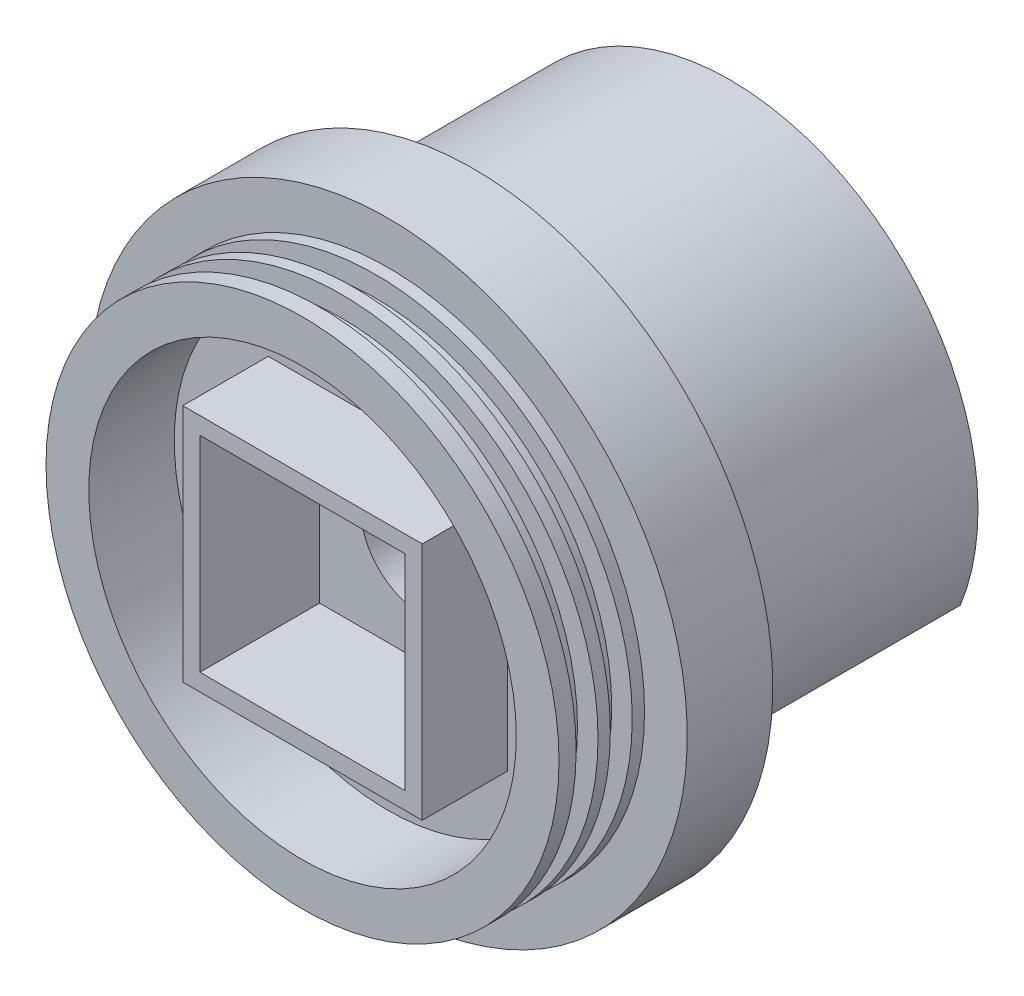
ISO-10303-21;
HEADER;
FILE_DESCRIPTION(('STEP AP214'),'2;1');
FILE_NAME('part.step','',(''),(''),'','','');
FILE_SCHEMA(('AUTOMOTIVE_DESIGN { 1 0 10303 214 1 1 1 1 }'));
ENDSEC;
DATA;
#1=APPLICATION_CONTEXT('core data for automotive mechanical design processes');
#2=APPLICATION_PROTOCOL_DEFINITION('international standard','automotive_design',2000,#1);
#3=PRODUCT_CONTEXT('',#1,'mechanical');
#4=PRODUCT('Part','Part','',(#3));
#5=PRODUCT_RELATED_PRODUCT_CATEGORY('part','',(#4));
#6=PRODUCT_DEFINITION_FORMATION('','',#4);
#7=PRODUCT_DEFINITION_CONTEXT('part definition',#1,'design');
#8=PRODUCT_DEFINITION('design','',#6,#7);
#9=PRODUCT_DEFINITION_SHAPE('','',#8);
#10=(LENGTH_UNIT() NAMED_UNIT(*) SI_UNIT(.MILLI.,.METRE.));
#11=(NAMED_UNIT(*) PLANE_ANGLE_UNIT() SI_UNIT($,.RADIAN.));
#12=(NAMED_UNIT(*) SI_UNIT($,.STERADIAN.) SOLID_ANGLE_UNIT());
#13=UNCERTAINTY_MEASURE_WITH_UNIT(LENGTH_MEASURE(1.E-05),#10,'distance_accuracy_value','');
#14=(GEOMETRIC_REPRESENTATION_CONTEXT(3) GLOBAL_UNCERTAINTY_ASSIGNED_CONTEXT((#13)) GLOBAL_UNIT_ASSIGNED_CONTEXT((#10,
#11,#12)) REPRESENTATION_CONTEXT('',''));
#15=CARTESIAN_POINT('',(0.,0.,0.));
#16=DIRECTION('',(0.,0.,1.));
#17=DIRECTION('',(1.,0.,0.));
#18=AXIS2_PLACEMENT_3D('',#15,#16,#17);
#19=CARTESIAN_POINT('',(0.,0.,0.));
#20=DIRECTION('',(0.,0.,1.));
#21=DIRECTION('',(1.,0.,0.));
#22=AXIS2_PLACEMENT_3D('',#19,#20,#21);
#23=PLANE('',#22);
#24=CARTESIAN_POINT('',(0.,0.,0.));
#25=DIRECTION('',(0.,0.,1.));
#26=DIRECTION('',(1.,0.,0.));
#27=AXIS2_PLACEMENT_3D('',#24,#25,#26);
#28=CIRCLE('',#27,31.75);
#29=CARTESIAN_POINT('',(31.75,0.,0.));
#30=VERTEX_POINT('',#29);
#31=EDGE_CURVE('E246',#30,#30,#28,.T.);
#32=ORIENTED_EDGE('',*,*,#31,.T.);
#33=EDGE_LOOP('',(#32));
#34=FACE_BOUND('',#33,.T.);
#35=DIRECTION('',(-1.,0.,0.));
#36=VECTOR('',#35,1.);
#37=CARTESIAN_POINT('',(-17.78,17.78,0.));
#38=LINE('',#37,#36);
#39=CARTESIAN_POINT('',(17.78,17.78,0.));
#40=VERTEX_POINT('',#39);
#41=CARTESIAN_POINT('',(-17.78,17.78,0.));
#42=VERTEX_POINT('',#41);
#43=EDGE_CURVE('E188',#40,#42,#38,.T.);
#44=ORIENTED_EDGE('',*,*,#43,.F.);
#45=DIRECTION('',(0.,1.,0.));
#46=VECTOR('',#45,1.);
#47=CARTESIAN_POINT('',(17.78,17.78,0.));
#48=LINE('',#47,#46);
#49=CARTESIAN_POINT('',(17.78,-17.78,0.));
#50=VERTEX_POINT('',#49);
#51=EDGE_CURVE('E174',#50,#40,#48,.T.);
#52=ORIENTED_EDGE('',*,*,#51,.F.);
#53=DIRECTION('',(1.,0.,0.));
#54=VECTOR('',#53,1.);
#55=CARTESIAN_POINT('',(17.78,-17.78,0.));
#56=LINE('',#55,#54);
#57=CARTESIAN_POINT('',(-17.78,-17.78,0.));
#58=VERTEX_POINT('',#57);
#59=EDGE_CURVE('E179',#58,#50,#56,.T.);
#60=ORIENTED_EDGE('',*,*,#59,.F.);
#61=DIRECTION('',(0.,-1.,0.));
#62=VECTOR('',#61,1.);
#63=CARTESIAN_POINT('',(-17.78,-17.78,0.));
#64=LINE('',#63,#62);
#65=EDGE_CURVE('E190',#42,#58,#64,.T.);
#66=ORIENTED_EDGE('',*,*,#65,.F.);
#67=EDGE_LOOP('',(#44,#52,#60,#66));
#68=FACE_BOUND('',#67,.T.);
#69=ADVANCED_FACE('F35',(#34,#68),#23,.T.);
#70=CARTESIAN_POINT('',(0.,0.,12.7));
#71=DIRECTION('',(0.,0.,-1.));
#72=DIRECTION('',(-1.,0.,0.));
#73=AXIS2_PLACEMENT_3D('',#70,#71,#72);
#74=CYLINDRICAL_SURFACE('',#73,38.1);
#75=CARTESIAN_POINT('',(0.,0.,0.));
#76=DIRECTION('',(0.,0.,1.));
#77=DIRECTION('',(1.,0.,0.));
#78=AXIS2_PLACEMENT_3D('',#75,#76,#77);
#79=CIRCLE('',#78,38.1);
#80=CARTESIAN_POINT('',(38.1,0.,0.));
#81=VERTEX_POINT('',#80);
#82=EDGE_CURVE('E271',#81,#81,#79,.T.);
#83=ORIENTED_EDGE('',*,*,#82,.T.);
#84=EDGE_LOOP('',(#83));
#85=FACE_BOUND('',#84,.T.);
#86=CARTESIAN_POINT('',(0.,0.,1.8288));
#87=DIRECTION('',(0.,0.,1.));
#88=DIRECTION('',(1.,0.,0.));
#89=AXIS2_PLACEMENT_3D('',#86,#87,#88);
#90=CIRCLE('',#89,38.1);
#91=CARTESIAN_POINT('',(38.1,0.,1.8288));
#92=VERTEX_POINT('',#91);
#93=EDGE_CURVE('E209',#92,#92,#90,.T.);
#94=ORIENTED_EDGE('',*,*,#93,.F.);
#95=EDGE_LOOP('',(#94));
#96=FACE_BOUND('',#95,.T.);
#97=ADVANCED_FACE('F330',(#85,#96),#74,.T.);
#98=CARTESIAN_POINT('',(0.,0.,5.08));
#99=DIRECTION('',(0.,0.,1.));
#100=DIRECTION('',(1.,0.,0.));
#101=AXIS2_PLACEMENT_3D('',#98,#99,#100);
#102=CIRCLE('',#101,38.1);
#103=CARTESIAN_POINT('',(38.1,0.,5.08));
#104=VERTEX_POINT('',#103);
#105=EDGE_CURVE('E205',#104,#104,#102,.T.);
#106=ORIENTED_EDGE('',*,*,#105,.T.);
#107=EDGE_LOOP('',(#106));
#108=FACE_BOUND('',#107,.T.);
#109=CARTESIAN_POINT('',(0.,0.,6.9088));
#110=DIRECTION('',(0.,0.,1.));
#111=DIRECTION('',(1.,0.,0.));
#112=AXIS2_PLACEMENT_3D('',#109,#110,#111);
#113=CIRCLE('',#112,38.1);
#114=CARTESIAN_POINT('',(38.1,0.,6.9088));
#115=VERTEX_POINT('',#114);
#116=EDGE_CURVE('E221',#115,#115,#113,.T.);
#117=ORIENTED_EDGE('',*,*,#116,.F.);
#118=EDGE_LOOP('',(#117));
#119=FACE_BOUND('',#118,.T.);
#120=ADVANCED_FACE('F338',(#108,#119),#74,.T.);
#121=CARTESIAN_POINT('',(0.,0.,-12.7));
#122=DIRECTION('',(0.,0.,-1.));
#123=DIRECTION('',(-1.,0.,0.));
#124=AXIS2_PLACEMENT_3D('',#121,#122,#123);
#125=PLANE('',#124);
#126=DIRECTION('',(-1.,0.,0.));
#127=VECTOR('',#126,1.);
#128=CARTESIAN_POINT('',(0.,-16.1793756215138,-12.7));
#129=LINE('',#128,#127);
#130=CARTESIAN_POINT('',(-35.8918473263493,-16.1793756215137,-12.7));
#131=VERTEX_POINT('',#130);
#132=CARTESIAN_POINT('',(-27.3183144519929,-16.1793756215138,-12.7));
#133=VERTEX_POINT('',#132);
#134=EDGE_CURVE('E288',#131,#133,#129,.F.);
#135=ORIENTED_EDGE('',*,*,#134,.T.);
#136=CARTESIAN_POINT('',(0.,0.,-12.7));
#137=DIRECTION('',(0.,0.,-1.));
#138=DIRECTION('',(-1.,0.,0.));
#139=AXIS2_PLACEMENT_3D('',#136,#137,#138);
#140=CIRCLE('',#139,31.75);
#141=CARTESIAN_POINT('',(27.3183144519929,-16.1793756215138,-12.7));
#142=VERTEX_POINT('',#141);
#143=EDGE_CURVE('E290',#133,#142,#140,.T.);
#144=ORIENTED_EDGE('',*,*,#143,.T.);
#145=DIRECTION('',(-1.,0.,0.));
#146=VECTOR('',#145,1.);
#147=CARTESIAN_POINT('',(0.,-16.1793756215138,-12.7));
#148=LINE('',#147,#146);
#149=CARTESIAN_POINT('',(35.8918473263493,-16.1793756215137,-12.7));
#150=VERTEX_POINT('',#149);
#151=EDGE_CURVE('E286',#142,#150,#148,.F.);
#152=ORIENTED_EDGE('',*,*,#151,.T.);
#153=CARTESIAN_POINT('',(0.,0.,-12.7));
#154=DIRECTION('',(0.,0.,-1.));
#155=DIRECTION('',(-1.,0.,0.));
#156=AXIS2_PLACEMENT_3D('',#153,#154,#155);
#157=CIRCLE('',#156,39.37);
#158=EDGE_CURVE('E284',#150,#131,#157,.F.);
#159=ORIENTED_EDGE('',*,*,#158,.T.);
#160=EDGE_LOOP('',(#135,#144,#152,#159));
#161=FACE_BOUND('',#160,.T.);
#162=CARTESIAN_POINT('',(0.,0.,-12.7));
#163=DIRECTION('',(0.,0.,-1.));
#164=DIRECTION('',(-1.,0.,0.));
#165=AXIS2_PLACEMENT_3D('',#162,#163,#164);
#166=CIRCLE('',#165,9.144);
#167=CARTESIAN_POINT('',(-9.144,0.,-12.7));
#168=VERTEX_POINT('',#167);
#169=EDGE_CURVE('E264',#168,#168,#166,.T.);
#170=ORIENTED_EDGE('',*,*,#169,.F.);
#171=EDGE_LOOP('',(#170));
#172=FACE_BOUND('',#171,.T.);
#173=CARTESIAN_POINT('',(0.,0.,-12.7));
#174=DIRECTION('',(0.,0.,-1.));
#175=DIRECTION('',(-1.,0.,0.));
#176=AXIS2_PLACEMENT_3D('',#173,#174,#175);
#177=CIRCLE('',#176,44.45);
#178=CARTESIAN_POINT('',(-44.45,0.,-12.7));
#179=VERTEX_POINT('',#178);
#180=EDGE_CURVE('E268',#179,#179,#177,.T.);
#181=ORIENTED_EDGE('',*,*,#180,.T.);
#182=EDGE_LOOP('',(#181));
#183=FACE_BOUND('',#182,.T.);
#184=ADVANCED_FACE('F368',(#161,#172,#183),#125,.T.);
#185=CARTESIAN_POINT('',(15.24,15.24,-5.08));
#186=DIRECTION('',(1.,0.,0.));
#187=DIRECTION('',(0.,1.,0.));
#188=AXIS2_PLACEMENT_3D('',#185,#186,#187);
#189=PLANE('',#188);
#190=DIRECTION('',(0.,0.,1.));
#191=VECTOR('',#190,1.);
#192=CARTESIAN_POINT('',(15.24,-15.24,-5.08));
#193=LINE('',#192,#191);
#194=CARTESIAN_POINT('',(15.24,-15.24,-5.08));
#195=VERTEX_POINT('',#194);
#196=CARTESIAN_POINT('',(15.24,-15.24,12.7));
#197=VERTEX_POINT('',#196);
#198=EDGE_CURVE('E161',#195,#197,#193,.T.);
#199=ORIENTED_EDGE('',*,*,#198,.T.);
#200=DIRECTION('',(0.,1.,0.));
#201=VECTOR('',#200,1.);
#202=CARTESIAN_POINT('',(15.24,15.24,12.7));
#203=LINE('',#202,#201);
#204=CARTESIAN_POINT('',(15.24,15.24,12.7));
#205=VERTEX_POINT('',#204);
#206=EDGE_CURVE('E159',#197,#205,#203,.T.);
#207=ORIENTED_EDGE('',*,*,#206,.T.);
#208=DIRECTION('',(0.,0.,1.));
#209=VECTOR('',#208,1.);
#210=CARTESIAN_POINT('',(15.24,15.24,-5.08));
#211=LINE('',#210,#209);
#212=CARTESIAN_POINT('',(15.24,15.24,-5.08));
#213=VERTEX_POINT('',#212);
#214=EDGE_CURVE('E144',#213,#205,#211,.T.);
#215=ORIENTED_EDGE('',*,*,#214,.F.);
#216=DIRECTION('',(0.,1.,0.));
#217=VECTOR('',#216,1.);
#218=CARTESIAN_POINT('',(15.24,15.24,-5.08));
#219=LINE('',#218,#217);
#220=EDGE_CURVE('E249',#195,#213,#219,.T.);
#221=ORIENTED_EDGE('',*,*,#220,.F.);
#222=EDGE_LOOP('',(#199,#207,#215,#221));
#223=FACE_BOUND('',#222,.T.);
#224=ADVANCED_FACE('F160',(#223),#189,.F.);
#225=CARTESIAN_POINT('',(-15.24,-15.24,-5.08));
#226=DIRECTION('',(0.,-1.,0.));
#227=DIRECTION('',(0.,0.,-1.));
#228=AXIS2_PLACEMENT_3D('',#225,#226,#227);
#229=PLANE('',#228);
#230=DIRECTION('',(0.,0.,1.));
#231=VECTOR('',#230,1.);
#232=CARTESIAN_POINT('',(-15.24,-15.24,-5.08));
#233=LINE('',#232,#231);
#234=CARTESIAN_POINT('',(-15.24,-15.24,-5.08));
#235=VERTEX_POINT('',#234);
#236=CARTESIAN_POINT('',(-15.24,-15.24,12.7));
#237=VERTEX_POINT('',#236);
#238=EDGE_CURVE('E261',#235,#237,#233,.T.);
#239=ORIENTED_EDGE('',*,*,#238,.T.);
#240=DIRECTION('',(1.,0.,0.));
#241=VECTOR('',#240,1.);
#242=CARTESIAN_POINT('',(15.24,-15.24,12.7));
#243=LINE('',#242,#241);
#244=EDGE_CURVE('E170',#237,#197,#243,.T.);
#245=ORIENTED_EDGE('',*,*,#244,.T.);
#246=ORIENTED_EDGE('',*,*,#198,.F.);
#247=DIRECTION('',(1.,0.,0.));
#248=VECTOR('',#247,1.);
#249=CARTESIAN_POINT('',(-15.24,-15.24,-5.08));
#250=LINE('',#249,#248);
#251=EDGE_CURVE('E156',#235,#195,#250,.T.);
#252=ORIENTED_EDGE('',*,*,#251,.F.);
#253=EDGE_LOOP('',(#239,#245,#246,#252));
#254=FACE_BOUND('',#253,.T.);
#255=ADVANCED_FACE('F355',(#254),#229,.F.);
#256=CARTESIAN_POINT('',(-15.24,15.24,-5.08));
#257=DIRECTION('',(-1.,0.,0.));
#258=DIRECTION('',(0.,-1.,0.));
#259=AXIS2_PLACEMENT_3D('',#256,#257,#258);
#260=PLANE('',#259);
#261=DIRECTION('',(0.,0.,1.));
#262=VECTOR('',#261,1.);
#263=CARTESIAN_POINT('',(-15.24,15.24,-5.08));
#264=LINE('',#263,#262);
#265=CARTESIAN_POINT('',(-15.24,15.24,-5.08));
#266=VERTEX_POINT('',#265);
#267=CARTESIAN_POINT('',(-15.24,15.24,12.7));
#268=VERTEX_POINT('',#267);
#269=EDGE_CURVE('E155',#266,#268,#264,.T.);
#270=ORIENTED_EDGE('',*,*,#269,.T.);
#271=DIRECTION('',(0.,-1.,0.));
#272=VECTOR('',#271,1.);
#273=CARTESIAN_POINT('',(-15.24,-15.24,12.7));
#274=LINE('',#273,#272);
#275=EDGE_CURVE('E168',#268,#237,#274,.T.);
#276=ORIENTED_EDGE('',*,*,#275,.T.);
#277=ORIENTED_EDGE('',*,*,#238,.F.);
#278=DIRECTION('',(0.,-1.,0.));
#279=VECTOR('',#278,1.);
#280=CARTESIAN_POINT('',(-15.24,15.24,-5.08));
#281=LINE('',#280,#279);
#282=EDGE_CURVE('E254',#266,#235,#281,.T.);
#283=ORIENTED_EDGE('',*,*,#282,.F.);
#284=EDGE_LOOP('',(#270,#276,#277,#283));
#285=FACE_BOUND('',#284,.T.);
#286=ADVANCED_FACE('F358',(#285),#260,.F.);
#287=CARTESIAN_POINT('',(-15.24,15.24,-5.08));
#288=DIRECTION('',(0.,1.,0.));
#289=DIRECTION('',(0.,0.,1.));
#290=AXIS2_PLACEMENT_3D('',#287,#288,#289);
#291=PLANE('',#290);
#292=ORIENTED_EDGE('',*,*,#214,.T.);
#293=DIRECTION('',(-1.,0.,0.));
#294=VECTOR('',#293,1.);
#295=CARTESIAN_POINT('',(-15.24,15.24,12.7));
#296=LINE('',#295,#294);
#297=EDGE_CURVE('E148',#205,#268,#296,.T.);
#298=ORIENTED_EDGE('',*,*,#297,.T.);
#299=ORIENTED_EDGE('',*,*,#269,.F.);
#300=DIRECTION('',(-1.,0.,0.));
#301=VECTOR('',#300,1.);
#302=CARTESIAN_POINT('',(-15.24,15.24,-5.08));
#303=LINE('',#302,#301);
#304=EDGE_CURVE('E151',#213,#266,#303,.T.);
#305=ORIENTED_EDGE('',*,*,#304,.F.);
#306=EDGE_LOOP('',(#292,#298,#299,#305));
#307=FACE_BOUND('',#306,.T.);
#308=ADVANCED_FACE('F146',(#307),#291,.F.);
#309=CARTESIAN_POINT('',(0.,0.,12.7));
#310=DIRECTION('',(0.,0.,-1.));
#311=DIRECTION('',(-1.,0.,0.));
#312=AXIS2_PLACEMENT_3D('',#309,#310,#311);
#313=CYLINDRICAL_SURFACE('',#312,9.144);
#314=ORIENTED_EDGE('',*,*,#169,.T.);
#315=EDGE_LOOP('',(#314));
#316=FACE_BOUND('',#315,.T.);
#317=CARTESIAN_POINT('',(0.,0.,-5.08));
#318=DIRECTION('',(0.,0.,1.));
#319=DIRECTION('',(1.,0.,0.));
#320=AXIS2_PLACEMENT_3D('',#317,#318,#319);
#321=CIRCLE('',#320,9.144);
#322=CARTESIAN_POINT('',(9.144,0.,-5.08));
#323=VERTEX_POINT('',#322);
#324=EDGE_CURVE('E260',#323,#323,#321,.F.);
#325=ORIENTED_EDGE('',*,*,#324,.F.);
#326=EDGE_LOOP('',(#325));
#327=FACE_BOUND('',#326,.T.);
#328=ADVANCED_FACE('F365',(#316,#327),#313,.F.);
#329=CARTESIAN_POINT('',(0.,0.,10.16));
#330=DIRECTION('',(0.,0.,1.));
#331=DIRECTION('',(1.,0.,0.));
#332=AXIS2_PLACEMENT_3D('',#329,#330,#331);
#333=CIRCLE('',#332,38.1);
#334=CARTESIAN_POINT('',(38.1,0.,10.16));
#335=VERTEX_POINT('',#334);
#336=EDGE_CURVE('E218',#335,#335,#333,.T.);
#337=ORIENTED_EDGE('',*,*,#336,.T.);
#338=EDGE_LOOP('',(#337));
#339=FACE_BOUND('',#338,.T.);
#340=CARTESIAN_POINT('',(0.,0.,12.7));
#341=DIRECTION('',(0.,0.,1.));
#342=DIRECTION('',(1.,0.,0.));
#343=AXIS2_PLACEMENT_3D('',#340,#341,#342);
#344=CIRCLE('',#343,38.1);
#345=CARTESIAN_POINT('',(38.1,0.,12.7));
#346=VERTEX_POINT('',#345);
#347=EDGE_CURVE('E274',#346,#346,#344,.T.);
#348=ORIENTED_EDGE('',*,*,#347,.F.);
#349=EDGE_LOOP('',(#348));
#350=FACE_BOUND('',#349,.T.);
#351=ADVANCED_FACE('F340',(#339,#350),#74,.T.);
#352=CARTESIAN_POINT('',(0.,0.,12.7));
#353=DIRECTION('',(0.,0.,1.));
#354=DIRECTION('',(1.,0.,0.));
#355=AXIS2_PLACEMENT_3D('',#352,#353,#354);
#356=PLANE('',#355);
#357=CARTESIAN_POINT('',(0.,0.,12.7));
#358=DIRECTION('',(0.,0.,1.));
#359=DIRECTION('',(1.,0.,0.));
#360=AXIS2_PLACEMENT_3D('',#357,#358,#359);
#361=CIRCLE('',#360,31.75);
#362=CARTESIAN_POINT('',(31.75,0.,12.7));
#363=VERTEX_POINT('',#362);
#364=EDGE_CURVE('E245',#363,#363,#361,.T.);
#365=ORIENTED_EDGE('',*,*,#364,.F.);
#366=EDGE_LOOP('',(#365));
#367=FACE_BOUND('',#366,.T.);
#368=ORIENTED_EDGE('',*,*,#347,.T.);
#369=EDGE_LOOP('',(#368));
#370=FACE_BOUND('',#369,.T.);
#371=ADVANCED_FACE('F381',(#367,#370),#356,.T.);
#372=CARTESIAN_POINT('',(0.,0.,-12.7));
#373=DIRECTION('',(0.,0.,1.));
#374=DIRECTION('',(1.,0.,0.));
#375=AXIS2_PLACEMENT_3D('',#372,#373,#374);
#376=CYLINDRICAL_SURFACE('',#375,44.45);
#377=ORIENTED_EDGE('',*,*,#180,.F.);
#378=EDGE_LOOP('',(#377));
#379=FACE_BOUND('',#378,.T.);
#380=CARTESIAN_POINT('',(0.,0.,0.));
#381=DIRECTION('',(0.,0.,-1.));
#382=DIRECTION('',(-1.,0.,0.));
#383=AXIS2_PLACEMENT_3D('',#380,#381,#382);
#384=CIRCLE('',#383,44.45);
#385=CARTESIAN_POINT('',(-44.45,0.,0.));
#386=VERTEX_POINT('',#385);
#387=EDGE_CURVE('E267',#386,#386,#384,.T.);
#388=ORIENTED_EDGE('',*,*,#387,.T.);
#389=EDGE_LOOP('',(#388));
#390=FACE_BOUND('',#389,.T.);
#391=ADVANCED_FACE('F377',(#379,#390),#376,.T.);
#392=CARTESIAN_POINT('',(0.,0.,0.));
#393=DIRECTION('',(0.,0.,-1.));
#394=DIRECTION('',(-1.,0.,0.));
#395=AXIS2_PLACEMENT_3D('',#392,#393,#394);
#396=PLANE('',#395);
#397=ORIENTED_EDGE('',*,*,#82,.F.);
#398=EDGE_LOOP('',(#397));
#399=FACE_BOUND('',#398,.T.);
#400=ORIENTED_EDGE('',*,*,#387,.F.);
#401=EDGE_LOOP('',(#400));
#402=FACE_BOUND('',#401,.T.);
#403=ADVANCED_FACE('F353',(#399,#402),#396,.F.);
#404=CARTESIAN_POINT('',(0.,0.,-5.08));
#405=DIRECTION('',(0.,0.,1.));
#406=DIRECTION('',(1.,0.,0.));
#407=AXIS2_PLACEMENT_3D('',#404,#405,#406);
#408=PLANE('',#407);
#409=ORIENTED_EDGE('',*,*,#220,.T.);
#410=ORIENTED_EDGE('',*,*,#304,.T.);
#411=ORIENTED_EDGE('',*,*,#282,.T.);
#412=ORIENTED_EDGE('',*,*,#251,.T.);
#413=EDGE_LOOP('',(#409,#410,#411,#412));
#414=FACE_BOUND('',#413,.T.);
#415=ORIENTED_EDGE('',*,*,#324,.T.);
#416=EDGE_LOOP('',(#415));
#417=FACE_BOUND('',#416,.T.);
#418=ADVANCED_FACE('F349',(#414,#417),#408,.T.);
#419=CARTESIAN_POINT('',(0.,0.,0.));
#420=DIRECTION('',(0.,0.,1.));
#421=DIRECTION('',(1.,0.,0.));
#422=AXIS2_PLACEMENT_3D('',#419,#420,#421);
#423=CYLINDRICAL_SURFACE('',#422,31.75);
#424=ORIENTED_EDGE('',*,*,#31,.F.);
#425=EDGE_LOOP('',(#424));
#426=FACE_BOUND('',#425,.T.);
#427=ORIENTED_EDGE('',*,*,#364,.T.);
#428=EDGE_LOOP('',(#427));
#429=FACE_BOUND('',#428,.T.);
#430=ADVANCED_FACE('F346',(#426,#429),#423,.F.);
#431=CARTESIAN_POINT('',(0.,0.,-50.8));
#432=DIRECTION('',(0.,0.,1.));
#433=DIRECTION('',(1.,0.,0.));
#434=AXIS2_PLACEMENT_3D('',#431,#432,#433);
#435=CYLINDRICAL_SURFACE('',#434,36.83);
#436=DIRECTION('',(0.,0.,1.));
#437=VECTOR('',#436,1.);
#438=CARTESIAN_POINT('',(-34.2113480099112,-13.6393756215138,-50.8));
#439=LINE('',#438,#437);
#440=CARTESIAN_POINT('',(-34.2113480099112,-13.6393756215138,-50.8));
#441=VERTEX_POINT('',#440);
#442=CARTESIAN_POINT('',(-34.2113480099112,-13.6393756215138,-15.24));
#443=VERTEX_POINT('',#442);
#444=EDGE_CURVE('E235',#441,#443,#439,.T.);
#445=ORIENTED_EDGE('',*,*,#444,.T.);
#446=CARTESIAN_POINT('',(0.,0.,-15.24));
#447=DIRECTION('',(0.,0.,-1.));
#448=DIRECTION('',(-1.,0.,0.));
#449=AXIS2_PLACEMENT_3D('',#446,#447,#448);
#450=CIRCLE('',#449,36.83);
#451=CARTESIAN_POINT('',(34.2113480099112,-13.6393756215138,-15.24));
#452=VERTEX_POINT('',#451);
#453=EDGE_CURVE('E11',#443,#452,#450,.T.);
#454=ORIENTED_EDGE('',*,*,#453,.T.);
#455=DIRECTION('',(0.,0.,1.));
#456=VECTOR('',#455,1.);
#457=CARTESIAN_POINT('',(34.2113480099112,-13.6393756215138,-50.8));
#458=LINE('',#457,#456);
#459=CARTESIAN_POINT('',(34.2113480099112,-13.6393756215138,-50.8));
#460=VERTEX_POINT('',#459);
#461=EDGE_CURVE('E243',#460,#452,#458,.T.);
#462=ORIENTED_EDGE('',*,*,#461,.F.);
#463=CARTESIAN_POINT('',(0.,0.,-50.8));
#464=DIRECTION('',(0.,0.,-1.));
#465=DIRECTION('',(-1.,0.,0.));
#466=AXIS2_PLACEMENT_3D('',#463,#464,#465);
#467=CIRCLE('',#466,36.83);
#468=EDGE_CURVE('E224',#441,#460,#467,.T.);
#469=ORIENTED_EDGE('',*,*,#468,.F.);
#470=EDGE_LOOP('',(#445,#454,#462,#469));
#471=FACE_BOUND('',#470,.T.);
#472=ADVANCED_FACE('F344',(#471),#435,.T.);
#473=CARTESIAN_POINT('',(34.2113480099112,-13.6393756215138,-50.8));
#474=DIRECTION('',(0.,1.,0.));
#475=DIRECTION('',(0.,0.,1.));
#476=AXIS2_PLACEMENT_3D('',#473,#474,#475);
#477=PLANE('',#476);
#478=ORIENTED_EDGE('',*,*,#461,.T.);
#479=DIRECTION('',(-1.,0.,0.));
#480=VECTOR('',#479,1.);
#481=CARTESIAN_POINT('',(34.2113480099112,-13.6393756215138,-15.24));
#482=LINE('',#481,#480);
#483=CARTESIAN_POINT('',(31.4606346511836,-13.6393756215138,-15.24));
#484=VERTEX_POINT('',#483);
#485=EDGE_CURVE('E49',#452,#484,#482,.T.);
#486=ORIENTED_EDGE('',*,*,#485,.T.);
#487=DIRECTION('',(0.,0.,1.));
#488=VECTOR('',#487,1.);
#489=CARTESIAN_POINT('',(31.4606346511836,-13.6393756215138,-50.8));
#490=LINE('',#489,#488);
#491=CARTESIAN_POINT('',(31.4606346511836,-13.6393756215138,-50.8));
#492=VERTEX_POINT('',#491);
#493=EDGE_CURVE('E240',#492,#484,#490,.T.);
#494=ORIENTED_EDGE('',*,*,#493,.F.);
#495=DIRECTION('',(-1.,0.,0.));
#496=VECTOR('',#495,1.);
#497=CARTESIAN_POINT('',(34.2113480099112,-13.6393756215138,-50.8));
#498=LINE('',#497,#496);
#499=EDGE_CURVE('E229',#460,#492,#498,.T.);
#500=ORIENTED_EDGE('',*,*,#499,.F.);
#501=EDGE_LOOP('',(#478,#486,#494,#500));
#502=FACE_BOUND('',#501,.T.);
#503=ADVANCED_FACE('F423',(#502),#477,.F.);
#504=CARTESIAN_POINT('',(0.,0.,-50.8));
#505=DIRECTION('',(0.,0.,1.));
#506=DIRECTION('',(1.,0.,0.));
#507=AXIS2_PLACEMENT_3D('',#504,#505,#506);
#508=CYLINDRICAL_SURFACE('',#507,34.29);
#509=ORIENTED_EDGE('',*,*,#493,.T.);
#510=CARTESIAN_POINT('',(0.,0.,-15.24));
#511=DIRECTION('',(0.,0.,-1.));
#512=DIRECTION('',(-1.,0.,0.));
#513=AXIS2_PLACEMENT_3D('',#510,#511,#512);
#514=CIRCLE('',#513,34.29);
#515=CARTESIAN_POINT('',(-31.4606346511836,-13.6393756215138,-15.24));
#516=VERTEX_POINT('',#515);
#517=EDGE_CURVE('E277',#484,#516,#514,.F.);
#518=ORIENTED_EDGE('',*,*,#517,.T.);
#519=DIRECTION('',(0.,0.,1.));
#520=VECTOR('',#519,1.);
#521=CARTESIAN_POINT('',(-31.4606346511836,-13.6393756215138,-50.8));
#522=LINE('',#521,#520);
#523=CARTESIAN_POINT('',(-31.4606346511836,-13.6393756215138,-50.8));
#524=VERTEX_POINT('',#523);
#525=EDGE_CURVE('E237',#524,#516,#522,.T.);
#526=ORIENTED_EDGE('',*,*,#525,.F.);
#527=CARTESIAN_POINT('',(0.,0.,-50.8));
#528=DIRECTION('',(0.,0.,1.));
#529=DIRECTION('',(-1.,0.,0.));
#530=AXIS2_PLACEMENT_3D('',#527,#528,#529);
#531=CIRCLE('',#530,34.29);
#532=EDGE_CURVE('E231',#492,#524,#531,.T.);
#533=ORIENTED_EDGE('',*,*,#532,.F.);
#534=EDGE_LOOP('',(#509,#518,#526,#533));
#535=FACE_BOUND('',#534,.T.);
#536=ADVANCED_FACE('F420',(#535),#508,.F.);
#537=CARTESIAN_POINT('',(-31.4606346511836,-13.6393756215138,-50.8));
#538=DIRECTION('',(0.,1.,0.));
#539=DIRECTION('',(0.,0.,1.));
#540=AXIS2_PLACEMENT_3D('',#537,#538,#539);
#541=PLANE('',#540);
#542=ORIENTED_EDGE('',*,*,#525,.T.);
#543=DIRECTION('',(-1.,0.,0.));
#544=VECTOR('',#543,1.);
#545=CARTESIAN_POINT('',(-31.4606346511836,-13.6393756215138,-15.24));
#546=LINE('',#545,#544);
#547=EDGE_CURVE('E293',#516,#443,#546,.T.);
#548=ORIENTED_EDGE('',*,*,#547,.T.);
#549=ORIENTED_EDGE('',*,*,#444,.F.);
#550=DIRECTION('',(-1.,0.,0.));
#551=VECTOR('',#550,1.);
#552=CARTESIAN_POINT('',(-31.4606346511836,-13.6393756215138,-50.8));
#553=LINE('',#552,#551);
#554=EDGE_CURVE('E233',#524,#441,#553,.T.);
#555=ORIENTED_EDGE('',*,*,#554,.F.);
#556=EDGE_LOOP('',(#542,#548,#549,#555));
#557=FACE_BOUND('',#556,.T.);
#558=ADVANCED_FACE('F411',(#557),#541,.F.);
#559=CARTESIAN_POINT('',(0.,0.,-50.8));
#560=DIRECTION('',(0.,0.,-1.));
#561=DIRECTION('',(-1.,0.,0.));
#562=AXIS2_PLACEMENT_3D('',#559,#560,#561);
#563=PLANE('',#562);
#564=ORIENTED_EDGE('',*,*,#468,.T.);
#565=ORIENTED_EDGE('',*,*,#499,.T.);
#566=ORIENTED_EDGE('',*,*,#532,.T.);
#567=ORIENTED_EDGE('',*,*,#554,.T.);
#568=EDGE_LOOP('',(#564,#565,#566,#567));
#569=FACE_BOUND('',#568,.T.);
#570=ADVANCED_FACE('F401',(#569),#563,.T.);
#571=CARTESIAN_POINT('',(0.,0.,6.9088));
#572=DIRECTION('',(0.,0.,1.));
#573=DIRECTION('',(1.,0.,0.));
#574=AXIS2_PLACEMENT_3D('',#571,#572,#573);
#575=PLANE('',#574);
#576=CARTESIAN_POINT('',(0.,0.,6.9088));
#577=DIRECTION('',(0.,0.,1.));
#578=DIRECTION('',(1.,0.,0.));
#579=AXIS2_PLACEMENT_3D('',#576,#577,#578);
#580=CIRCLE('',#579,35.052);
#581=CARTESIAN_POINT('',(35.052,0.,6.9088));
#582=VERTEX_POINT('',#581);
#583=EDGE_CURVE('E215',#582,#582,#580,.T.);
#584=ORIENTED_EDGE('',*,*,#583,.F.);
#585=EDGE_LOOP('',(#584));
#586=FACE_BOUND('',#585,.T.);
#587=ORIENTED_EDGE('',*,*,#116,.T.);
#588=EDGE_LOOP('',(#587));
#589=FACE_BOUND('',#588,.T.);
#590=ADVANCED_FACE('F398',(#586,#589),#575,.T.);
#591=CARTESIAN_POINT('',(0.,0.,10.16));
#592=DIRECTION('',(0.,0.,1.));
#593=DIRECTION('',(1.,0.,0.));
#594=AXIS2_PLACEMENT_3D('',#591,#592,#593);
#595=PLANE('',#594);
#596=CARTESIAN_POINT('',(0.,0.,10.16));
#597=DIRECTION('',(0.,0.,1.));
#598=DIRECTION('',(1.,0.,0.));
#599=AXIS2_PLACEMENT_3D('',#596,#597,#598);
#600=CIRCLE('',#599,35.052);
#601=CARTESIAN_POINT('',(35.052,0.,10.16));
#602=VERTEX_POINT('',#601);
#603=EDGE_CURVE('E212',#602,#602,#600,.T.);
#604=ORIENTED_EDGE('',*,*,#603,.T.);
#605=EDGE_LOOP('',(#604));
#606=FACE_BOUND('',#605,.T.);
#607=ORIENTED_EDGE('',*,*,#336,.F.);
#608=EDGE_LOOP('',(#607));
#609=FACE_BOUND('',#608,.T.);
#610=ADVANCED_FACE('F400',(#606,#609),#595,.F.);
#611=CARTESIAN_POINT('',(0.,0.,6.9088));
#612=DIRECTION('',(0.,0.,1.));
#613=DIRECTION('',(1.,0.,0.));
#614=AXIS2_PLACEMENT_3D('',#611,#612,#613);
#615=CYLINDRICAL_SURFACE('',#614,35.052);
#616=ORIENTED_EDGE('',*,*,#583,.T.);
#617=EDGE_LOOP('',(#616));
#618=FACE_BOUND('',#617,.T.);
#619=ORIENTED_EDGE('',*,*,#603,.F.);
#620=EDGE_LOOP('',(#619));
#621=FACE_BOUND('',#620,.T.);
#622=ADVANCED_FACE('F408',(#618,#621),#615,.T.);
#623=CARTESIAN_POINT('',(0.,0.,1.8288));
#624=DIRECTION('',(0.,0.,1.));
#625=DIRECTION('',(1.,0.,0.));
#626=AXIS2_PLACEMENT_3D('',#623,#624,#625);
#627=PLANE('',#626);
#628=CARTESIAN_POINT('',(0.,0.,1.8288));
#629=DIRECTION('',(0.,0.,1.));
#630=DIRECTION('',(1.,0.,0.));
#631=AXIS2_PLACEMENT_3D('',#628,#629,#630);
#632=CIRCLE('',#631,35.052);
#633=CARTESIAN_POINT('',(35.052,0.,1.8288));
#634=VERTEX_POINT('',#633);
#635=EDGE_CURVE('E202',#634,#634,#632,.T.);
#636=ORIENTED_EDGE('',*,*,#635,.F.);
#637=EDGE_LOOP('',(#636));
#638=FACE_BOUND('',#637,.T.);
#639=ORIENTED_EDGE('',*,*,#93,.T.);
#640=EDGE_LOOP('',(#639));
#641=FACE_BOUND('',#640,.T.);
#642=ADVANCED_FACE('F582',(#638,#641),#627,.T.);
#643=CARTESIAN_POINT('',(0.,0.,5.08));
#644=DIRECTION('',(0.,0.,1.));
#645=DIRECTION('',(1.,0.,0.));
#646=AXIS2_PLACEMENT_3D('',#643,#644,#645);
#647=PLANE('',#646);
#648=CARTESIAN_POINT('',(0.,0.,5.08));
#649=DIRECTION('',(0.,0.,1.));
#650=DIRECTION('',(1.,0.,0.));
#651=AXIS2_PLACEMENT_3D('',#648,#649,#650);
#652=CIRCLE('',#651,35.052);
#653=CARTESIAN_POINT('',(35.052,0.,5.08));
#654=VERTEX_POINT('',#653);
#655=EDGE_CURVE('E206',#654,#654,#652,.T.);
#656=ORIENTED_EDGE('',*,*,#655,.T.);
#657=EDGE_LOOP('',(#656));
#658=FACE_BOUND('',#657,.T.);
#659=ORIENTED_EDGE('',*,*,#105,.F.);
#660=EDGE_LOOP('',(#659));
#661=FACE_BOUND('',#660,.T.);
#662=ADVANCED_FACE('F593',(#658,#661),#647,.F.);
#663=CARTESIAN_POINT('',(0.,0.,1.8288));
#664=DIRECTION('',(0.,0.,1.));
#665=DIRECTION('',(1.,0.,0.));
#666=AXIS2_PLACEMENT_3D('',#663,#664,#665);
#667=CYLINDRICAL_SURFACE('',#666,35.052);
#668=ORIENTED_EDGE('',*,*,#635,.T.);
#669=EDGE_LOOP('',(#668));
#670=FACE_BOUND('',#669,.T.);
#671=ORIENTED_EDGE('',*,*,#655,.F.);
#672=EDGE_LOOP('',(#671));
#673=FACE_BOUND('',#672,.T.);
#674=ADVANCED_FACE('F326',(#670,#673),#667,.T.);
#675=CARTESIAN_POINT('',(0.,0.,-15.24));
#676=DIRECTION('',(0.,0.,-1.));
#677=DIRECTION('',(-1.,0.,0.));
#678=AXIS2_PLACEMENT_3D('',#675,#676,#677);
#679=TOROIDAL_SURFACE('',#678,39.37,2.54);
#680=CARTESIAN_POINT('',(-34.2113480099112,-13.6393756215138,-15.24));
#681=CARTESIAN_POINT('',(-34.2113394456264,-13.6393636505248,-15.1771957743297));
#682=CARTESIAN_POINT('',(-34.2129267458622,-13.6417046247219,-15.1143990252256));
#683=CARTESIAN_POINT('',(-34.2192275307458,-13.6510006228616,-14.9893324712645));
#684=CARTESIAN_POINT('',(-34.2239396530681,-13.6579536360989,-14.9270624487472));
#685=CARTESIAN_POINT('',(-34.2363918359917,-13.6763335949023,-14.803830435439));
#686=CARTESIAN_POINT('',(-34.2441158536057,-13.6877368364007,-14.7428632903074));
#687=CARTESIAN_POINT('',(-34.2624663114758,-13.7148410566865,-14.6223516514391));
#688=CARTESIAN_POINT('',(-34.2730929402661,-13.7305423146446,-14.5628072503876));
#689=CARTESIAN_POINT('',(-34.3090781986923,-13.7837429038578,-14.3870828051454));
#690=CARTESIAN_POINT('',(-34.3385717829181,-13.8273826182632,-14.2735273290807));
#691=CARTESIAN_POINT('',(-34.4070943316305,-13.9289460932457,-14.0560989894794));
#692=CARTESIAN_POINT('',(-34.4461343204282,-13.986886369024,-13.9522375136798));
#693=CARTESIAN_POINT('',(-34.5349245724368,-14.1189356229755,-13.7494446924439));
#694=CARTESIAN_POINT('',(-34.5852064507818,-14.1938513687883,-13.6512739010978));
#695=CARTESIAN_POINT('',(-34.6928621445373,-14.3546528543792,-13.4689020474978));
#696=CARTESIAN_POINT('',(-34.7502372725601,-14.4405406246387,-13.3847035776072));
#697=CARTESIAN_POINT('',(-34.8803191511568,-14.6358008966403,-13.2181114214459));
#698=CARTESIAN_POINT('',(-34.9539965851347,-14.7467141293231,-13.1382828784599));
#699=CARTESIAN_POINT('',(-35.1065990275831,-14.9772249107001,-12.9984275005795));
#700=CARTESIAN_POINT('',(-35.1855312865696,-15.0968344803084,-12.9384287365115));
#701=CARTESIAN_POINT('',(-35.3664131894345,-15.3719037675228,-12.8261395139749));
#702=CARTESIAN_POINT('',(-35.4692806453978,-15.5289911259359,-12.7792998656132));
#703=CARTESIAN_POINT('',(-35.6769679471566,-15.8475730086073,-12.7165543958639));
#704=CARTESIAN_POINT('',(-35.7817828943751,-16.0090568533917,-12.7005794021949));
#705=CARTESIAN_POINT('',(-35.8880278421913,-16.1734644858318,-12.7000051527935));
#706=CARTESIAN_POINT('',(-35.8899376695067,-16.1764200663747,-12.6999999939615));
#707=CARTESIAN_POINT('',(-35.8918473263493,-16.1793756215138,-12.7));
#708=B_SPLINE_CURVE_WITH_KNOTS('',3,(#680,#681,#682,#683,#684,#685,#686,#687,#688,#689,#690,
#691,#692,#693,#694,#695,#696,#697,#698,#699,#700,#701,#702,#703,#704,#705,#706,#707),
.UNSPECIFIED.,.F.,.F.,(4,2,2,2,2,2,2,2,2,2,2,2,2,4),(0.,0.188336633402521,0.376591211816143,
0.563856448417508,0.751133851405758,1.12483273180313,1.49896521960999,1.89744230808835,
2.29599324579924,2.75996823568487,3.22459723826429,3.80256929929732,4.37924452955075,
4.38980132538466),.UNSPECIFIED.);
#709=EDGE_CURVE('E438',#131,#443,#708,.F.);
#710=ORIENTED_EDGE('',*,*,#709,.F.);
#711=ORIENTED_EDGE('',*,*,#158,.F.);
#712=CARTESIAN_POINT('',(34.2113480099112,-13.6393756215138,-15.24));
#713=CARTESIAN_POINT('',(34.2113394456264,-13.6393636505248,-15.1771957743297));
#714=CARTESIAN_POINT('',(34.2129267458622,-13.6417046247219,-15.1143990252256));
#715=CARTESIAN_POINT('',(34.2192275307458,-13.6510006228616,-14.9893324712645));
#716=CARTESIAN_POINT('',(34.2239396530681,-13.6579536360989,-14.9270624487472));
#717=CARTESIAN_POINT('',(34.2363918359917,-13.6763335949023,-14.803830435439));
#718=CARTESIAN_POINT('',(34.2441158536057,-13.6877368364007,-14.7428632903074));
#719=CARTESIAN_POINT('',(34.2624663114758,-13.7148410566865,-14.6223516514391));
#720=CARTESIAN_POINT('',(34.2730929402661,-13.7305423146446,-14.5628072503876));
#721=CARTESIAN_POINT('',(34.3090781986923,-13.7837429038578,-14.3870828051454));
#722=CARTESIAN_POINT('',(34.3385717829181,-13.8273826182632,-14.2735273290807));
#723=CARTESIAN_POINT('',(34.4070943316305,-13.9289460932457,-14.0560989894794));
#724=CARTESIAN_POINT('',(34.4461343204282,-13.986886369024,-13.9522375136798));
#725=CARTESIAN_POINT('',(34.5349245724368,-14.1189356229755,-13.7494446924439));
#726=CARTESIAN_POINT('',(34.5852064507818,-14.1938513687883,-13.6512739010978));
#727=CARTESIAN_POINT('',(34.6928621445373,-14.3546528543792,-13.4689020474978));
#728=CARTESIAN_POINT('',(34.7502372725601,-14.4405406246387,-13.3847035776072));
#729=CARTESIAN_POINT('',(34.8803191511568,-14.6358008966403,-13.2181114214459));
#730=CARTESIAN_POINT('',(34.9539965851347,-14.7467141293231,-13.1382828784599));
#731=CARTESIAN_POINT('',(35.1065990275831,-14.9772249107001,-12.9984275005795));
#732=CARTESIAN_POINT('',(35.1855312865696,-15.0968344803084,-12.9384287365115));
#733=CARTESIAN_POINT('',(35.3664131894345,-15.3719037675228,-12.8261395139749));
#734=CARTESIAN_POINT('',(35.4692806453978,-15.5289911259359,-12.7792998656132));
#735=CARTESIAN_POINT('',(35.6769679471566,-15.8475730086073,-12.7165543958639));
#736=CARTESIAN_POINT('',(35.7817828943751,-16.0090568533917,-12.7005794021949));
#737=CARTESIAN_POINT('',(35.8880278421913,-16.1734644858318,-12.7000051527935));
#738=CARTESIAN_POINT('',(35.8899376695067,-16.1764200663747,-12.6999999939615));
#739=CARTESIAN_POINT('',(35.8918473263493,-16.1793756215138,-12.7));
#740=B_SPLINE_CURVE_WITH_KNOTS('',3,(#712,#713,#714,#715,#716,#717,#718,#719,#720,#721,#722,
#723,#724,#725,#726,#727,#728,#729,#730,#731,#732,#733,#734,#735,#736,#737,#738,#739),
.UNSPECIFIED.,.F.,.F.,(4,2,2,2,2,2,2,2,2,2,2,2,2,4),(0.,0.188336633402521,0.376591211816144,
0.563856448417509,0.751133851405758,1.12483273180313,1.49896521960999,1.89744230808835,
2.29599324579924,2.75996823568487,3.22459723826429,3.80256929929732,4.37924452955075,
4.38980132538466),.UNSPECIFIED.);
#741=EDGE_CURVE('E40',#452,#150,#740,.T.);
#742=ORIENTED_EDGE('',*,*,#741,.F.);
#743=ORIENTED_EDGE('',*,*,#453,.F.);
#744=EDGE_LOOP('',(#710,#711,#742,#743));
#745=FACE_BOUND('',#744,.T.);
#746=ADVANCED_FACE('F37',(#745),#679,.F.);
#747=CARTESIAN_POINT('',(34.2113480099112,-16.1793756215138,-15.24));
#748=DIRECTION('',(-1.,0.,0.));
#749=DIRECTION('',(0.,0.,1.));
#750=AXIS2_PLACEMENT_3D('',#747,#748,#749);
#751=CYLINDRICAL_SURFACE('',#750,2.54);
#752=ORIENTED_EDGE('',*,*,#741,.T.);
#753=ORIENTED_EDGE('',*,*,#151,.F.);
#754=CARTESIAN_POINT('',(31.4606346511836,-13.6393756215138,-15.24));
#755=CARTESIAN_POINT('',(31.4606469316359,-13.6393672520582,-15.1983598866422));
#756=CARTESIAN_POINT('',(31.4590751059142,-13.6403992940918,-15.1567277639287));
#757=CARTESIAN_POINT('',(31.4528575612512,-13.64448002121,-15.0738254875967));
#758=CARTESIAN_POINT('',(31.448214297499,-13.6475270955549,-15.0325550715211));
#759=CARTESIAN_POINT('',(31.4359994894912,-13.6555400653982,-14.9509990243365));
#760=CARTESIAN_POINT('',(31.42845289506,-13.6604896116511,-14.9107080306885));
#761=CARTESIAN_POINT('',(31.4105970299936,-13.6721948143514,-14.8310153602003));
#762=CARTESIAN_POINT('',(31.4002873253202,-13.6789507545526,-14.7916138241342));
#763=CARTESIAN_POINT('',(31.3655722130862,-13.7016855010839,-14.6753203717187));
#764=CARTESIAN_POINT('',(31.3373313967791,-13.7201637196266,-14.6000251872929));
#765=CARTESIAN_POINT('',(31.2723506950699,-13.7626056150184,-14.4547728777706));
#766=CARTESIAN_POINT('',(31.2355913487484,-13.7865818509725,-14.384828470947));
#767=CARTESIAN_POINT('',(31.1283538171619,-13.8563779892432,-14.2057159060572));
#768=CARTESIAN_POINT('',(31.0517932814451,-13.9060649201755,-14.1016939269596));
#769=CARTESIAN_POINT('',(30.8859400809309,-14.0132293881824,-13.9089696361513));
#770=CARTESIAN_POINT('',(30.7966136324925,-14.0707275763149,-13.8203094007665));
#771=CARTESIAN_POINT('',(30.6242648600881,-14.1811326774031,-13.6696880231066));
#772=CARTESIAN_POINT('',(30.5424978991022,-14.2333163279397,-13.6057231077499));
#773=CARTESIAN_POINT('',(30.3743905691904,-14.3401462835256,-13.4863586543779));
#774=CARTESIAN_POINT('',(30.2880470348113,-14.3947942890781,-13.4309651514928));
#775=CARTESIAN_POINT('',(30.1117833658984,-14.5058569588493,-13.3277522149836));
#776=CARTESIAN_POINT('',(30.0218566533807,-14.5622748276097,-13.2799475978844));
#777=CARTESIAN_POINT('',(29.8393415797917,-14.6762509371009,-13.1912379937966));
#778=CARTESIAN_POINT('',(29.7467522149194,-14.7338096052945,-13.1503356499076));
#779=CARTESIAN_POINT('',(29.4689319329063,-14.9056911438084,-13.0382076317181));
#780=CARTESIAN_POINT('',(29.2807180919457,-15.0210685318693,-12.9759191361798));
#781=CARTESIAN_POINT('',(28.8991466144939,-15.2526595189352,-12.871686424739));
#782=CARTESIAN_POINT('',(28.7057834636092,-15.3688739084743,-12.8297650267533));
#783=CARTESIAN_POINT('',(28.3159942771265,-15.6007401131805,-12.763856170589));
#784=CARTESIAN_POINT('',(28.119571189661,-15.7163923441337,-12.7398524231445));
#785=CARTESIAN_POINT('',(27.7248393961081,-15.9463505849777,-12.7080533361424));
#786=CARTESIAN_POINT('',(27.5265322611456,-16.0606575643506,-12.7002455101003));
#787=CARTESIAN_POINT('',(27.3246081256011,-16.1757881059197,-12.7000019050033));
#788=CARTESIAN_POINT('',(27.3214613466434,-16.1775819860036,-12.7000000052894));
#789=CARTESIAN_POINT('',(27.3183144519929,-16.1793756215138,-12.7));
#790=B_SPLINE_CURVE_WITH_KNOTS('',3,(#754,#755,#756,#757,#758,#759,#760,#761,#762,#763,#764,
#765,#766,#767,#768,#769,#770,#771,#772,#773,#774,#775,#776,#777,#778,#779,#780,#781,#782,#783,
#784,#785,#786,#787,#788,#789),.UNSPECIFIED.,.F.,.F.,(4,2,2,2,2,2,2,2,2,2,2,2,2,2,2,2,2,4),(0.,
0.124864918014484,0.24963014425003,0.373346320024802,0.497081940940806,0.743604515180854,
0.99069593105462,1.40346567162596,1.81734871838893,2.16543453333259,2.51376433102908,
2.8627660579672,3.211901126957,3.89873930501619,4.58634520574319,5.27332522739257,
5.95977541450968,5.97064196819375),.UNSPECIFIED.);
#791=EDGE_CURVE('E303',#484,#142,#790,.T.);
#792=ORIENTED_EDGE('',*,*,#791,.F.);
#793=ORIENTED_EDGE('',*,*,#485,.F.);
#794=EDGE_LOOP('',(#752,#753,#792,#793));
#795=FACE_BOUND('',#794,.T.);
#796=ADVANCED_FACE('F315',(#795),#751,.F.);
#797=CARTESIAN_POINT('',(-31.4606346511836,-16.1793756215138,-15.24));
#798=DIRECTION('',(-1.,0.,0.));
#799=DIRECTION('',(0.,0.,1.));
#800=AXIS2_PLACEMENT_3D('',#797,#798,#799);
#801=CYLINDRICAL_SURFACE('',#800,2.54);
#802=ORIENTED_EDGE('',*,*,#709,.T.);
#803=ORIENTED_EDGE('',*,*,#547,.F.);
#804=CARTESIAN_POINT('',(-31.4606346511836,-13.6393756215138,-15.24));
#805=CARTESIAN_POINT('',(-31.4606469316359,-13.6393672520582,-15.1983598866422));
#806=CARTESIAN_POINT('',(-31.4590751059142,-13.6403992940918,-15.1567277639287));
#807=CARTESIAN_POINT('',(-31.4528575612512,-13.64448002121,-15.0738254875967));
#808=CARTESIAN_POINT('',(-31.448214297499,-13.6475270955549,-15.0325550715211));
#809=CARTESIAN_POINT('',(-31.4359994894912,-13.6555400653982,-14.9509990243365));
#810=CARTESIAN_POINT('',(-31.42845289506,-13.6604896116511,-14.9107080306885));
#811=CARTESIAN_POINT('',(-31.4105970299936,-13.6721948143514,-14.8310153602003));
#812=CARTESIAN_POINT('',(-31.4002873253202,-13.6789507545526,-14.7916138241342));
#813=CARTESIAN_POINT('',(-31.3655722130862,-13.7016855010839,-14.6753203717187));
#814=CARTESIAN_POINT('',(-31.3373313967791,-13.7201637196266,-14.6000251872929));
#815=CARTESIAN_POINT('',(-31.2723506950699,-13.7626056150184,-14.4547728777706));
#816=CARTESIAN_POINT('',(-31.2355913487484,-13.7865818509725,-14.384828470947));
#817=CARTESIAN_POINT('',(-31.1283538171619,-13.8563779892432,-14.2057159060572));
#818=CARTESIAN_POINT('',(-31.0517932814451,-13.9060649201755,-14.1016939269596));
#819=CARTESIAN_POINT('',(-30.8859400809309,-14.0132293881824,-13.9089696361513));
#820=CARTESIAN_POINT('',(-30.7966136324925,-14.0707275763149,-13.8203094007665));
#821=CARTESIAN_POINT('',(-30.6242648600881,-14.1811326774031,-13.6696880231066));
#822=CARTESIAN_POINT('',(-30.5424978991022,-14.2333163279397,-13.6057231077499));
#823=CARTESIAN_POINT('',(-30.3743905691904,-14.3401462835256,-13.4863586543779));
#824=CARTESIAN_POINT('',(-30.2880470348113,-14.3947942890781,-13.4309651514928));
#825=CARTESIAN_POINT('',(-30.1117833658984,-14.5058569588492,-13.3277522149836));
#826=CARTESIAN_POINT('',(-30.0218566533807,-14.5622748276097,-13.2799475978844));
#827=CARTESIAN_POINT('',(-29.8393415797917,-14.6762509371009,-13.1912379937966));
#828=CARTESIAN_POINT('',(-29.7467522149194,-14.7338096052945,-13.1503356499076));
#829=CARTESIAN_POINT('',(-29.4689319329063,-14.9056911438084,-13.0382076317181));
#830=CARTESIAN_POINT('',(-29.2807180919457,-15.0210685318693,-12.9759191361798));
#831=CARTESIAN_POINT('',(-28.8991466144939,-15.2526595189353,-12.871686424739));
#832=CARTESIAN_POINT('',(-28.7057834636092,-15.3688739084745,-12.8297650267533));
#833=CARTESIAN_POINT('',(-28.3159942771264,-15.6007401131803,-12.763856170589));
#834=CARTESIAN_POINT('',(-28.1195711896605,-15.716392344133,-12.7398524231445));
#835=CARTESIAN_POINT('',(-27.7248393961085,-15.9463505849784,-12.7080533361424));
#836=CARTESIAN_POINT('',(-27.5265322611471,-16.0606575643531,-12.7002455101003));
#837=CARTESIAN_POINT('',(-27.3246081256011,-16.1757881059198,-12.7000019050033));
#838=CARTESIAN_POINT('',(-27.3214613466435,-16.1775819860036,-12.7000000052894));
#839=CARTESIAN_POINT('',(-27.3183144519929,-16.1793756215138,-12.7));
#840=B_SPLINE_CURVE_WITH_KNOTS('',3,(#804,#805,#806,#807,#808,#809,#810,#811,#812,#813,#814,
#815,#816,#817,#818,#819,#820,#821,#822,#823,#824,#825,#826,#827,#828,#829,#830,#831,#832,#833,
#834,#835,#836,#837,#838,#839),.UNSPECIFIED.,.F.,.F.,(4,2,2,2,2,2,2,2,2,2,2,2,2,2,2,2,2,4),(0.,
0.124864918014483,0.24963014425003,0.373346320024804,0.497081940940806,0.743604515180853,
0.990695931054619,1.40346567162596,1.81734871838893,2.16543453333258,2.51376433102906,
2.86276605796719,3.211901126957,3.89873930501621,4.58634520574328,5.27332522739263,
5.95977541450967,5.97064196819375),.UNSPECIFIED.);
#841=EDGE_CURVE('E201',#133,#516,#840,.F.);
#842=ORIENTED_EDGE('',*,*,#841,.F.);
#843=ORIENTED_EDGE('',*,*,#134,.F.);
#844=EDGE_LOOP('',(#802,#803,#842,#843));
#845=FACE_BOUND('',#844,.T.);
#846=ADVANCED_FACE('F308',(#845),#801,.F.);
#847=CARTESIAN_POINT('',(0.,0.,-15.24));
#848=DIRECTION('',(0.,0.,-1.));
#849=DIRECTION('',(-1.,0.,0.));
#850=AXIS2_PLACEMENT_3D('',#847,#848,#849);
#851=TOROIDAL_SURFACE('',#850,31.75,2.54);
#852=ORIENTED_EDGE('',*,*,#791,.T.);
#853=ORIENTED_EDGE('',*,*,#143,.F.);
#854=ORIENTED_EDGE('',*,*,#841,.T.);
#855=ORIENTED_EDGE('',*,*,#517,.F.);
#856=EDGE_LOOP('',(#852,#853,#854,#855));
#857=FACE_BOUND('',#856,.T.);
#858=ADVANCED_FACE('F311',(#857),#851,.F.);
#859=CARTESIAN_POINT('',(0.,0.,12.7));
#860=DIRECTION('',(0.,0.,-1.));
#861=DIRECTION('',(-1.,0.,0.));
#862=AXIS2_PLACEMENT_3D('',#859,#860,#861);
#863=PLANE('',#862);
#864=DIRECTION('',(0.,1.,0.));
#865=VECTOR('',#864,1.);
#866=CARTESIAN_POINT('',(17.78,17.78,12.7));
#867=LINE('',#866,#865);
#868=CARTESIAN_POINT('',(17.78,-17.78,12.7));
#869=VERTEX_POINT('',#868);
#870=CARTESIAN_POINT('',(17.78,17.78,12.7));
#871=VERTEX_POINT('',#870);
#872=EDGE_CURVE('E175',#869,#871,#867,.T.);
#873=ORIENTED_EDGE('',*,*,#872,.T.);
#874=DIRECTION('',(-1.,0.,0.));
#875=VECTOR('',#874,1.);
#876=CARTESIAN_POINT('',(-17.78,17.78,12.7));
#877=LINE('',#876,#875);
#878=CARTESIAN_POINT('',(-17.78,17.78,12.7));
#879=VERTEX_POINT('',#878);
#880=EDGE_CURVE('E178',#871,#879,#877,.T.);
#881=ORIENTED_EDGE('',*,*,#880,.T.);
#882=DIRECTION('',(0.,-1.,0.));
#883=VECTOR('',#882,1.);
#884=CARTESIAN_POINT('',(-17.78,-17.78,12.7));
#885=LINE('',#884,#883);
#886=CARTESIAN_POINT('',(-17.78,-17.78,12.7));
#887=VERTEX_POINT('',#886);
#888=EDGE_CURVE('E181',#879,#887,#885,.T.);
#889=ORIENTED_EDGE('',*,*,#888,.T.);
#890=DIRECTION('',(1.,0.,0.));
#891=VECTOR('',#890,1.);
#892=CARTESIAN_POINT('',(17.78,-17.78,12.7));
#893=LINE('',#892,#891);
#894=EDGE_CURVE('E183',#887,#869,#893,.T.);
#895=ORIENTED_EDGE('',*,*,#894,.T.);
#896=EDGE_LOOP('',(#873,#881,#889,#895));
#897=FACE_BOUND('',#896,.T.);
#898=ORIENTED_EDGE('',*,*,#206,.F.);
#899=ORIENTED_EDGE('',*,*,#244,.F.);
#900=ORIENTED_EDGE('',*,*,#275,.F.);
#901=ORIENTED_EDGE('',*,*,#297,.F.);
#902=EDGE_LOOP('',(#898,#899,#900,#901));
#903=FACE_BOUND('',#902,.T.);
#904=ADVANCED_FACE('F166',(#897,#903),#863,.F.);
#905=CARTESIAN_POINT('',(17.78,17.78,12.7));
#906=DIRECTION('',(-1.,0.,0.));
#907=DIRECTION('',(0.,0.,1.));
#908=AXIS2_PLACEMENT_3D('',#905,#906,#907);
#909=PLANE('',#908);
#910=ORIENTED_EDGE('',*,*,#51,.T.);
#911=DIRECTION('',(0.,0.,-1.));
#912=VECTOR('',#911,1.);
#913=CARTESIAN_POINT('',(17.78,17.78,12.7));
#914=LINE('',#913,#912);
#915=EDGE_CURVE('E199',#871,#40,#914,.T.);
#916=ORIENTED_EDGE('',*,*,#915,.F.);
#917=ORIENTED_EDGE('',*,*,#872,.F.);
#918=DIRECTION('',(0.,0.,-1.));
#919=VECTOR('',#918,1.);
#920=CARTESIAN_POINT('',(17.78,-17.78,12.7));
#921=LINE('',#920,#919);
#922=EDGE_CURVE('E185',#869,#50,#921,.T.);
#923=ORIENTED_EDGE('',*,*,#922,.T.);
#924=EDGE_LOOP('',(#910,#916,#917,#923));
#925=FACE_BOUND('',#924,.T.);
#926=ADVANCED_FACE('F644',(#925),#909,.F.);
#927=CARTESIAN_POINT('',(-17.78,17.78,12.7));
#928=DIRECTION('',(0.,-1.,0.));
#929=DIRECTION('',(0.,0.,-1.));
#930=AXIS2_PLACEMENT_3D('',#927,#928,#929);
#931=PLANE('',#930);
#932=ORIENTED_EDGE('',*,*,#43,.T.);
#933=DIRECTION('',(0.,0.,-1.));
#934=VECTOR('',#933,1.);
#935=CARTESIAN_POINT('',(-17.78,17.78,12.7));
#936=LINE('',#935,#934);
#937=EDGE_CURVE('E196',#879,#42,#936,.T.);
#938=ORIENTED_EDGE('',*,*,#937,.F.);
#939=ORIENTED_EDGE('',*,*,#880,.F.);
#940=ORIENTED_EDGE('',*,*,#915,.T.);
#941=EDGE_LOOP('',(#932,#938,#939,#940));
#942=FACE_BOUND('',#941,.T.);
#943=ADVANCED_FACE('F651',(#942),#931,.F.);
#944=CARTESIAN_POINT('',(-17.78,-17.78,12.7));
#945=DIRECTION('',(1.,0.,0.));
#946=DIRECTION('',(0.,0.,-1.));
#947=AXIS2_PLACEMENT_3D('',#944,#945,#946);
#948=PLANE('',#947);
#949=ORIENTED_EDGE('',*,*,#65,.T.);
#950=DIRECTION('',(0.,0.,-1.));
#951=VECTOR('',#950,1.);
#952=CARTESIAN_POINT('',(-17.78,-17.78,12.7));
#953=LINE('',#952,#951);
#954=EDGE_CURVE('E57',#887,#58,#953,.T.);
#955=ORIENTED_EDGE('',*,*,#954,.F.);
#956=ORIENTED_EDGE('',*,*,#888,.F.);
#957=ORIENTED_EDGE('',*,*,#937,.T.);
#958=EDGE_LOOP('',(#949,#955,#956,#957));
#959=FACE_BOUND('',#958,.T.);
#960=ADVANCED_FACE('F659',(#959),#948,.F.);
#961=CARTESIAN_POINT('',(17.78,-17.78,12.7));
#962=DIRECTION('',(0.,1.,0.));
#963=DIRECTION('',(0.,0.,1.));
#964=AXIS2_PLACEMENT_3D('',#961,#962,#963);
#965=PLANE('',#964);
#966=ORIENTED_EDGE('',*,*,#59,.T.);
#967=ORIENTED_EDGE('',*,*,#922,.F.);
#968=ORIENTED_EDGE('',*,*,#894,.F.);
#969=ORIENTED_EDGE('',*,*,#954,.T.);
#970=EDGE_LOOP('',(#966,#967,#968,#969));
#971=FACE_BOUND('',#970,.T.);
#972=ADVANCED_FACE('F667',(#971),#965,.F.);
#973=CLOSED_SHELL('',(#69,#97,#120,#184,#224,#255,#286,#308,#328,#351,#371,#391,#403,#418,#430,
#472,#503,#536,#558,#570,#590,#610,#622,#642,#662,#674,#746,#796,#846,#858,#904,#926,#943,#960,#972));
#974=MANIFOLD_SOLID_BREP('B2',#973);
#975=ADVANCED_BREP_SHAPE_REPRESENTATION('',(#18,#974),#14);
#976=SHAPE_DEFINITION_REPRESENTATION(#9,#975);
ENDSEC;
END-ISO-10303-21;
